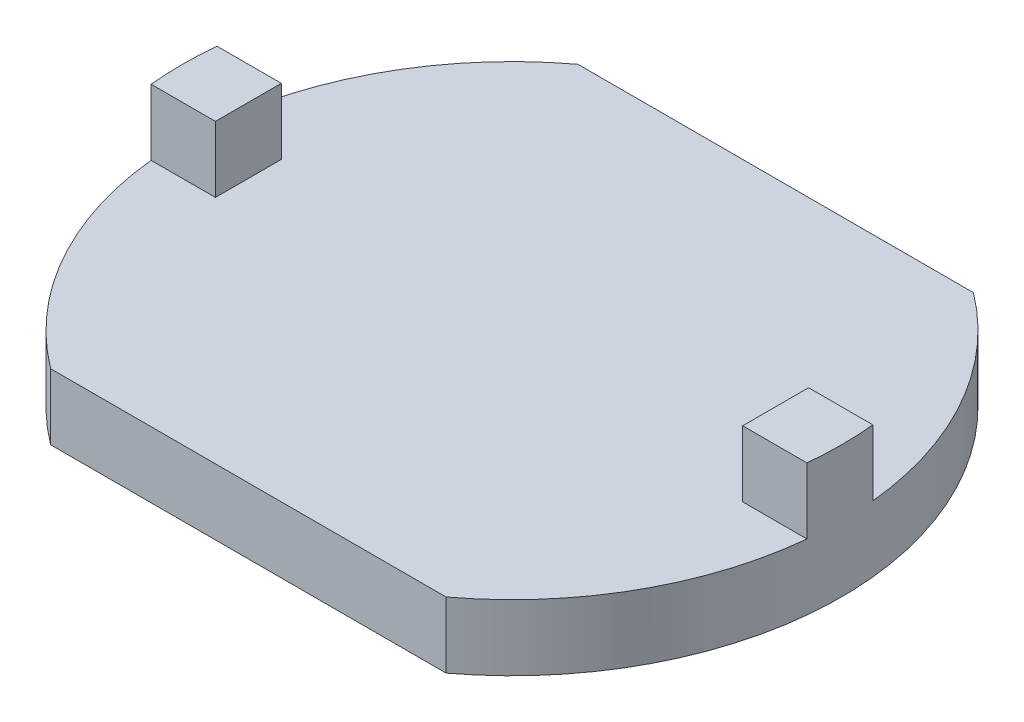
ISO-10303-21;
HEADER;
FILE_DESCRIPTION(('STEP AP214'),'2;1');
FILE_NAME('part.step','',(''),(''),'','','');
FILE_SCHEMA(('AUTOMOTIVE_DESIGN { 1 0 10303 214 1 1 1 1 }'));
ENDSEC;
DATA;
#1=APPLICATION_CONTEXT('core data for automotive mechanical design processes');
#2=APPLICATION_PROTOCOL_DEFINITION('international standard','automotive_design',2000,#1);
#3=PRODUCT_CONTEXT('',#1,'mechanical');
#4=PRODUCT('Part','Part','',(#3));
#5=PRODUCT_RELATED_PRODUCT_CATEGORY('part','',(#4));
#6=PRODUCT_DEFINITION_FORMATION('','',#4);
#7=PRODUCT_DEFINITION_CONTEXT('part definition',#1,'design');
#8=PRODUCT_DEFINITION('design','',#6,#7);
#9=PRODUCT_DEFINITION_SHAPE('','',#8);
#10=(LENGTH_UNIT() NAMED_UNIT(*) SI_UNIT(.MILLI.,.METRE.));
#11=(NAMED_UNIT(*) PLANE_ANGLE_UNIT() SI_UNIT($,.RADIAN.));
#12=(NAMED_UNIT(*) SI_UNIT($,.STERADIAN.) SOLID_ANGLE_UNIT());
#13=UNCERTAINTY_MEASURE_WITH_UNIT(LENGTH_MEASURE(1.E-05),#10,'distance_accuracy_value','');
#14=(GEOMETRIC_REPRESENTATION_CONTEXT(3) GLOBAL_UNCERTAINTY_ASSIGNED_CONTEXT((#13)) GLOBAL_UNIT_ASSIGNED_CONTEXT((#10,
#11,#12)) REPRESENTATION_CONTEXT('',''));
#15=CARTESIAN_POINT('',(0.,0.,0.));
#16=DIRECTION('',(0.,0.,1.));
#17=DIRECTION('',(1.,0.,0.));
#18=AXIS2_PLACEMENT_3D('',#15,#16,#17);
#19=CARTESIAN_POINT('',(0.,1.,0.));
#20=DIRECTION('',(0.,1.,0.));
#21=DIRECTION('',(0.,0.,1.));
#22=AXIS2_PLACEMENT_3D('',#19,#20,#21);
#23=PLANE('',#22);
#24=DIRECTION('',(-1.,0.,0.));
#25=VECTOR('',#24,1.);
#26=CARTESIAN_POINT('',(-4.,1.,0.5));
#27=LINE('',#26,#25);
#28=CARTESIAN_POINT('',(-4.,1.,0.5));
#29=VERTEX_POINT('',#28);
#30=CARTESIAN_POINT('',(-4.9749371855331,1.,0.499999999999996));
#31=VERTEX_POINT('',#30);
#32=EDGE_CURVE('E137',#29,#31,#27,.T.);
#33=ORIENTED_EDGE('',*,*,#32,.T.);
#34=CARTESIAN_POINT('',(0.,1.,0.));
#35=DIRECTION('',(0.,1.,0.));
#36=DIRECTION('',(0.,0.,1.));
#37=AXIS2_PLACEMENT_3D('',#34,#35,#36);
#38=CIRCLE('',#37,5.);
#39=CARTESIAN_POINT('',(-3.,1.,4.));
#40=VERTEX_POINT('',#39);
#41=EDGE_CURVE('E125',#31,#40,#38,.T.);
#42=ORIENTED_EDGE('',*,*,#41,.T.);
#43=DIRECTION('',(1.,0.,0.));
#44=VECTOR('',#43,1.);
#45=CARTESIAN_POINT('',(-3.,1.,4.));
#46=LINE('',#45,#44);
#47=CARTESIAN_POINT('',(3.,1.,4.));
#48=VERTEX_POINT('',#47);
#49=EDGE_CURVE('E134',#40,#48,#46,.T.);
#50=ORIENTED_EDGE('',*,*,#49,.T.);
#51=CARTESIAN_POINT('',(0.,1.,0.));
#52=DIRECTION('',(0.,1.,0.));
#53=DIRECTION('',(0.,0.,1.));
#54=AXIS2_PLACEMENT_3D('',#51,#52,#53);
#55=CIRCLE('',#54,5.);
#56=CARTESIAN_POINT('',(4.9749371855331,1.,0.5));
#57=VERTEX_POINT('',#56);
#58=EDGE_CURVE('E196',#48,#57,#55,.T.);
#59=ORIENTED_EDGE('',*,*,#58,.T.);
#60=DIRECTION('',(1.,0.,0.));
#61=VECTOR('',#60,1.);
#62=CARTESIAN_POINT('',(0.,1.,0.5));
#63=LINE('',#62,#61);
#64=CARTESIAN_POINT('',(4.,1.,0.5));
#65=VERTEX_POINT('',#64);
#66=EDGE_CURVE('E167',#65,#57,#63,.T.);
#67=ORIENTED_EDGE('',*,*,#66,.F.);
#68=DIRECTION('',(0.,0.,-1.));
#69=VECTOR('',#68,1.);
#70=CARTESIAN_POINT('',(4.,1.,0.));
#71=LINE('',#70,#69);
#72=CARTESIAN_POINT('',(4.,1.,-0.5));
#73=VERTEX_POINT('',#72);
#74=EDGE_CURVE('E177',#65,#73,#71,.T.);
#75=ORIENTED_EDGE('',*,*,#74,.T.);
#76=DIRECTION('',(1.,0.,0.));
#77=VECTOR('',#76,1.);
#78=CARTESIAN_POINT('',(0.,1.,-0.5));
#79=LINE('',#78,#77);
#80=CARTESIAN_POINT('',(4.9749371855331,1.,-0.5));
#81=VERTEX_POINT('',#80);
#82=EDGE_CURVE('E139',#73,#81,#79,.T.);
#83=ORIENTED_EDGE('',*,*,#82,.T.);
#84=CARTESIAN_POINT('',(3.,1.,-4.));
#85=VERTEX_POINT('',#84);
#86=EDGE_CURVE('E194',#81,#85,#55,.T.);
#87=ORIENTED_EDGE('',*,*,#86,.T.);
#88=DIRECTION('',(1.,0.,0.));
#89=VECTOR('',#88,1.);
#90=CARTESIAN_POINT('',(-3.,1.,-4.));
#91=LINE('',#90,#89);
#92=CARTESIAN_POINT('',(-3.,1.,-4.));
#93=VERTEX_POINT('',#92);
#94=EDGE_CURVE('E191',#93,#85,#91,.T.);
#95=ORIENTED_EDGE('',*,*,#94,.F.);
#96=CARTESIAN_POINT('',(-4.9749371855331,1.,-0.499999999999998));
#97=VERTEX_POINT('',#96);
#98=EDGE_CURVE('E133',#93,#97,#38,.T.);
#99=ORIENTED_EDGE('',*,*,#98,.T.);
#100=DIRECTION('',(-1.,0.,0.));
#101=VECTOR('',#100,1.);
#102=CARTESIAN_POINT('',(-4.,1.,-0.5));
#103=LINE('',#102,#101);
#104=CARTESIAN_POINT('',(-4.,1.,-0.5));
#105=VERTEX_POINT('',#104);
#106=EDGE_CURVE('E58',#105,#97,#103,.T.);
#107=ORIENTED_EDGE('',*,*,#106,.F.);
#108=DIRECTION('',(0.,0.,-1.));
#109=VECTOR('',#108,1.);
#110=CARTESIAN_POINT('',(-4.,1.,0.5));
#111=LINE('',#110,#109);
#112=EDGE_CURVE('E53',#29,#105,#111,.T.);
#113=ORIENTED_EDGE('',*,*,#112,.F.);
#114=EDGE_LOOP('',(#33,#42,#50,#59,#67,#75,#83,#87,#95,#99,#107,#113));
#115=FACE_BOUND('',#114,.T.);
#116=ADVANCED_FACE('F36',(#115),#23,.T.);
#117=CARTESIAN_POINT('',(-3.,1.,-4.));
#118=DIRECTION('',(0.,0.,-1.));
#119=DIRECTION('',(-1.,0.,0.));
#120=AXIS2_PLACEMENT_3D('',#117,#118,#119);
#121=PLANE('',#120);
#122=DIRECTION('',(1.,0.,0.));
#123=VECTOR('',#122,1.);
#124=CARTESIAN_POINT('',(-3.,0.,-4.));
#125=LINE('',#124,#123);
#126=CARTESIAN_POINT('',(-3.,0.,-4.));
#127=VERTEX_POINT('',#126);
#128=CARTESIAN_POINT('',(3.,0.,-4.));
#129=VERTEX_POINT('',#128);
#130=EDGE_CURVE('E190',#127,#129,#125,.T.);
#131=ORIENTED_EDGE('',*,*,#130,.F.);
#132=DIRECTION('',(0.,-1.,0.));
#133=VECTOR('',#132,1.);
#134=CARTESIAN_POINT('',(-3.,1.,-4.));
#135=LINE('',#134,#133);
#136=EDGE_CURVE('E11',#93,#127,#135,.T.);
#137=ORIENTED_EDGE('',*,*,#136,.F.);
#138=ORIENTED_EDGE('',*,*,#94,.T.);
#139=DIRECTION('',(0.,-1.,0.));
#140=VECTOR('',#139,1.);
#141=CARTESIAN_POINT('',(3.,1.,-4.));
#142=LINE('',#141,#140);
#143=EDGE_CURVE('E40',#85,#129,#142,.T.);
#144=ORIENTED_EDGE('',*,*,#143,.T.);
#145=EDGE_LOOP('',(#131,#137,#138,#144));
#146=FACE_BOUND('',#145,.T.);
#147=ADVANCED_FACE('F38',(#146),#121,.T.);
#148=CARTESIAN_POINT('',(0.,1.,0.));
#149=DIRECTION('',(0.,-1.,0.));
#150=DIRECTION('',(0.,0.,-1.));
#151=AXIS2_PLACEMENT_3D('',#148,#149,#150);
#152=CYLINDRICAL_SURFACE('',#151,5.);
#153=CARTESIAN_POINT('',(0.,0.,0.));
#154=DIRECTION('',(0.,1.,0.));
#155=DIRECTION('',(0.,0.,1.));
#156=AXIS2_PLACEMENT_3D('',#153,#154,#155);
#157=CIRCLE('',#156,5.);
#158=CARTESIAN_POINT('',(-3.,0.,4.));
#159=VERTEX_POINT('',#158);
#160=EDGE_CURVE('E195',#127,#159,#157,.T.);
#161=ORIENTED_EDGE('',*,*,#160,.T.);
#162=DIRECTION('',(0.,-1.,0.));
#163=VECTOR('',#162,1.);
#164=CARTESIAN_POINT('',(-3.,1.,4.));
#165=LINE('',#164,#163);
#166=EDGE_CURVE('E45',#40,#159,#165,.T.);
#167=ORIENTED_EDGE('',*,*,#166,.F.);
#168=ORIENTED_EDGE('',*,*,#41,.F.);
#169=DIRECTION('',(0.,-1.,0.));
#170=VECTOR('',#169,1.);
#171=CARTESIAN_POINT('',(-4.9749371855331,2.,0.499999999999996));
#172=LINE('',#171,#170);
#173=CARTESIAN_POINT('',(-4.9749371855331,2.,0.499999999999996));
#174=VERTEX_POINT('',#173);
#175=EDGE_CURVE('E129',#174,#31,#172,.T.);
#176=ORIENTED_EDGE('',*,*,#175,.F.);
#177=CARTESIAN_POINT('',(6.86083134748827E-13,2.,0.));
#178=DIRECTION('',(0.,1.,0.));
#179=DIRECTION('',(0.,0.,1.));
#180=AXIS2_PLACEMENT_3D('',#177,#178,#179);
#181=CIRCLE('',#180,5.00000000000068);
#182=CARTESIAN_POINT('',(-4.9749371855331,2.,-0.499999999999998));
#183=VERTEX_POINT('',#182);
#184=EDGE_CURVE('E160',#183,#174,#181,.T.);
#185=ORIENTED_EDGE('',*,*,#184,.F.);
#186=DIRECTION('',(0.,-1.,0.));
#187=VECTOR('',#186,1.);
#188=CARTESIAN_POINT('',(-4.9749371855331,2.,-0.499999999999998));
#189=LINE('',#188,#187);
#190=EDGE_CURVE('E145',#183,#97,#189,.T.);
#191=ORIENTED_EDGE('',*,*,#190,.T.);
#192=ORIENTED_EDGE('',*,*,#98,.F.);
#193=ORIENTED_EDGE('',*,*,#136,.T.);
#194=EDGE_LOOP('',(#161,#167,#168,#176,#185,#191,#192,#193));
#195=FACE_BOUND('',#194,.T.);
#196=ADVANCED_FACE('F126',(#195),#152,.T.);
#197=CARTESIAN_POINT('',(-3.,1.,4.));
#198=DIRECTION('',(0.,0.,-1.));
#199=DIRECTION('',(-1.,0.,0.));
#200=AXIS2_PLACEMENT_3D('',#197,#198,#199);
#201=PLANE('',#200);
#202=DIRECTION('',(1.,0.,0.));
#203=VECTOR('',#202,1.);
#204=CARTESIAN_POINT('',(-3.,0.,4.));
#205=LINE('',#204,#203);
#206=CARTESIAN_POINT('',(3.,0.,4.));
#207=VERTEX_POINT('',#206);
#208=EDGE_CURVE('E205',#159,#207,#205,.T.);
#209=ORIENTED_EDGE('',*,*,#208,.T.);
#210=DIRECTION('',(0.,-1.,0.));
#211=VECTOR('',#210,1.);
#212=CARTESIAN_POINT('',(3.,1.,4.));
#213=LINE('',#212,#211);
#214=EDGE_CURVE('E208',#48,#207,#213,.T.);
#215=ORIENTED_EDGE('',*,*,#214,.F.);
#216=ORIENTED_EDGE('',*,*,#49,.F.);
#217=ORIENTED_EDGE('',*,*,#166,.T.);
#218=EDGE_LOOP('',(#209,#215,#216,#217));
#219=FACE_BOUND('',#218,.T.);
#220=ADVANCED_FACE('F226',(#219),#201,.F.);
#221=CARTESIAN_POINT('',(0.,1.,0.));
#222=DIRECTION('',(0.,-1.,0.));
#223=DIRECTION('',(0.,0.,-1.));
#224=AXIS2_PLACEMENT_3D('',#221,#222,#223);
#225=CYLINDRICAL_SURFACE('',#224,5.);
#226=CARTESIAN_POINT('',(0.,0.,0.));
#227=DIRECTION('',(0.,1.,0.));
#228=DIRECTION('',(0.,0.,1.));
#229=AXIS2_PLACEMENT_3D('',#226,#227,#228);
#230=CIRCLE('',#229,5.);
#231=EDGE_CURVE('E202',#207,#129,#230,.T.);
#232=ORIENTED_EDGE('',*,*,#231,.T.);
#233=ORIENTED_EDGE('',*,*,#143,.F.);
#234=ORIENTED_EDGE('',*,*,#86,.F.);
#235=DIRECTION('',(0.,-1.,0.));
#236=VECTOR('',#235,1.);
#237=CARTESIAN_POINT('',(4.9749371855331,2.,-0.5));
#238=LINE('',#237,#236);
#239=CARTESIAN_POINT('',(4.9749371855331,2.,-0.5));
#240=VERTEX_POINT('',#239);
#241=EDGE_CURVE('E174',#240,#81,#238,.T.);
#242=ORIENTED_EDGE('',*,*,#241,.F.);
#243=CARTESIAN_POINT('',(0.,2.,0.));
#244=DIRECTION('',(0.,1.,0.));
#245=DIRECTION('',(0.,0.,1.));
#246=AXIS2_PLACEMENT_3D('',#243,#244,#245);
#247=CIRCLE('',#246,5.);
#248=CARTESIAN_POINT('',(4.9749371855331,2.,0.5));
#249=VERTEX_POINT('',#248);
#250=EDGE_CURVE('E172',#249,#240,#247,.T.);
#251=ORIENTED_EDGE('',*,*,#250,.F.);
#252=DIRECTION('',(0.,-1.,0.));
#253=VECTOR('',#252,1.);
#254=CARTESIAN_POINT('',(4.9749371855331,2.,0.5));
#255=LINE('',#254,#253);
#256=EDGE_CURVE('E182',#249,#57,#255,.T.);
#257=ORIENTED_EDGE('',*,*,#256,.T.);
#258=ORIENTED_EDGE('',*,*,#58,.F.);
#259=ORIENTED_EDGE('',*,*,#214,.T.);
#260=EDGE_LOOP('',(#232,#233,#234,#242,#251,#257,#258,#259));
#261=FACE_BOUND('',#260,.T.);
#262=ADVANCED_FACE('F219',(#261),#225,.T.);
#263=CARTESIAN_POINT('',(0.,0.,0.));
#264=DIRECTION('',(0.,1.,0.));
#265=DIRECTION('',(0.,0.,1.));
#266=AXIS2_PLACEMENT_3D('',#263,#264,#265);
#267=PLANE('',#266);
#268=ORIENTED_EDGE('',*,*,#130,.T.);
#269=ORIENTED_EDGE('',*,*,#231,.F.);
#270=ORIENTED_EDGE('',*,*,#208,.F.);
#271=ORIENTED_EDGE('',*,*,#160,.F.);
#272=EDGE_LOOP('',(#268,#269,#270,#271));
#273=FACE_BOUND('',#272,.T.);
#274=ADVANCED_FACE('F223',(#273),#267,.F.);
#275=CARTESIAN_POINT('',(0.,2.,-0.5));
#276=DIRECTION('',(0.,0.,-1.));
#277=DIRECTION('',(-1.,0.,0.));
#278=AXIS2_PLACEMENT_3D('',#275,#276,#277);
#279=PLANE('',#278);
#280=ORIENTED_EDGE('',*,*,#82,.F.);
#281=DIRECTION('',(0.,-1.,0.));
#282=VECTOR('',#281,1.);
#283=CARTESIAN_POINT('',(4.,2.,-0.5));
#284=LINE('',#283,#282);
#285=CARTESIAN_POINT('',(4.,2.,-0.5));
#286=VERTEX_POINT('',#285);
#287=EDGE_CURVE('E187',#286,#73,#284,.T.);
#288=ORIENTED_EDGE('',*,*,#287,.F.);
#289=DIRECTION('',(1.,0.,0.));
#290=VECTOR('',#289,1.);
#291=CARTESIAN_POINT('',(0.,2.,-0.5));
#292=LINE('',#291,#290);
#293=EDGE_CURVE('E163',#286,#240,#292,.T.);
#294=ORIENTED_EDGE('',*,*,#293,.T.);
#295=ORIENTED_EDGE('',*,*,#241,.T.);
#296=EDGE_LOOP('',(#280,#288,#294,#295));
#297=FACE_BOUND('',#296,.T.);
#298=ADVANCED_FACE('F240',(#297),#279,.T.);
#299=CARTESIAN_POINT('',(4.,2.,0.));
#300=DIRECTION('',(-1.,0.,0.));
#301=DIRECTION('',(0.,0.,1.));
#302=AXIS2_PLACEMENT_3D('',#299,#300,#301);
#303=PLANE('',#302);
#304=ORIENTED_EDGE('',*,*,#74,.F.);
#305=DIRECTION('',(0.,-1.,0.));
#306=VECTOR('',#305,1.);
#307=CARTESIAN_POINT('',(4.,2.,0.5));
#308=LINE('',#307,#306);
#309=CARTESIAN_POINT('',(4.,2.,0.5));
#310=VERTEX_POINT('',#309);
#311=EDGE_CURVE('E185',#310,#65,#308,.T.);
#312=ORIENTED_EDGE('',*,*,#311,.F.);
#313=DIRECTION('',(0.,0.,-1.));
#314=VECTOR('',#313,1.);
#315=CARTESIAN_POINT('',(4.,2.,0.));
#316=LINE('',#315,#314);
#317=EDGE_CURVE('E166',#310,#286,#316,.T.);
#318=ORIENTED_EDGE('',*,*,#317,.T.);
#319=ORIENTED_EDGE('',*,*,#287,.T.);
#320=EDGE_LOOP('',(#304,#312,#318,#319));
#321=FACE_BOUND('',#320,.T.);
#322=ADVANCED_FACE('F237',(#321),#303,.T.);
#323=CARTESIAN_POINT('',(0.,2.,0.5));
#324=DIRECTION('',(0.,0.,-1.));
#325=DIRECTION('',(-1.,0.,0.));
#326=AXIS2_PLACEMENT_3D('',#323,#324,#325);
#327=PLANE('',#326);
#328=ORIENTED_EDGE('',*,*,#66,.T.);
#329=ORIENTED_EDGE('',*,*,#256,.F.);
#330=DIRECTION('',(1.,0.,0.));
#331=VECTOR('',#330,1.);
#332=CARTESIAN_POINT('',(0.,2.,0.5));
#333=LINE('',#332,#331);
#334=EDGE_CURVE('E170',#310,#249,#333,.T.);
#335=ORIENTED_EDGE('',*,*,#334,.F.);
#336=ORIENTED_EDGE('',*,*,#311,.T.);
#337=EDGE_LOOP('',(#328,#329,#335,#336));
#338=FACE_BOUND('',#337,.T.);
#339=ADVANCED_FACE('F233',(#338),#327,.F.);
#340=CARTESIAN_POINT('',(0.,2.,0.));
#341=DIRECTION('',(0.,1.,0.));
#342=DIRECTION('',(0.,0.,1.));
#343=AXIS2_PLACEMENT_3D('',#340,#341,#342);
#344=PLANE('',#343);
#345=ORIENTED_EDGE('',*,*,#293,.F.);
#346=ORIENTED_EDGE('',*,*,#317,.F.);
#347=ORIENTED_EDGE('',*,*,#334,.T.);
#348=ORIENTED_EDGE('',*,*,#250,.T.);
#349=EDGE_LOOP('',(#345,#346,#347,#348));
#350=FACE_BOUND('',#349,.T.);
#351=ADVANCED_FACE('F242',(#350),#344,.T.);
#352=CARTESIAN_POINT('',(-4.,2.,0.5));
#353=DIRECTION('',(0.,0.,1.));
#354=DIRECTION('',(1.,0.,0.));
#355=AXIS2_PLACEMENT_3D('',#352,#353,#354);
#356=PLANE('',#355);
#357=ORIENTED_EDGE('',*,*,#32,.F.);
#358=DIRECTION('',(0.,-1.,0.));
#359=VECTOR('',#358,1.);
#360=CARTESIAN_POINT('',(-4.,2.,0.5));
#361=LINE('',#360,#359);
#362=CARTESIAN_POINT('',(-4.,2.,0.5));
#363=VERTEX_POINT('',#362);
#364=EDGE_CURVE('E155',#363,#29,#361,.T.);
#365=ORIENTED_EDGE('',*,*,#364,.F.);
#366=DIRECTION('',(-1.,0.,0.));
#367=VECTOR('',#366,1.);
#368=CARTESIAN_POINT('',(-4.,2.,0.5));
#369=LINE('',#368,#367);
#370=EDGE_CURVE('E143',#363,#174,#369,.T.);
#371=ORIENTED_EDGE('',*,*,#370,.T.);
#372=ORIENTED_EDGE('',*,*,#175,.T.);
#373=EDGE_LOOP('',(#357,#365,#371,#372));
#374=FACE_BOUND('',#373,.T.);
#375=ADVANCED_FACE('F141',(#374),#356,.T.);
#376=CARTESIAN_POINT('',(-4.,2.,0.5));
#377=DIRECTION('',(-1.,0.,0.));
#378=DIRECTION('',(0.,0.,1.));
#379=AXIS2_PLACEMENT_3D('',#376,#377,#378);
#380=PLANE('',#379);
#381=ORIENTED_EDGE('',*,*,#112,.T.);
#382=DIRECTION('',(0.,-1.,0.));
#383=VECTOR('',#382,1.);
#384=CARTESIAN_POINT('',(-4.,2.,-0.5));
#385=LINE('',#384,#383);
#386=CARTESIAN_POINT('',(-4.,2.,-0.5));
#387=VERTEX_POINT('',#386);
#388=EDGE_CURVE('E150',#387,#105,#385,.T.);
#389=ORIENTED_EDGE('',*,*,#388,.F.);
#390=DIRECTION('',(0.,0.,-1.));
#391=VECTOR('',#390,1.);
#392=CARTESIAN_POINT('',(-4.,2.,0.5));
#393=LINE('',#392,#391);
#394=EDGE_CURVE('E144',#363,#387,#393,.T.);
#395=ORIENTED_EDGE('',*,*,#394,.F.);
#396=ORIENTED_EDGE('',*,*,#364,.T.);
#397=EDGE_LOOP('',(#381,#389,#395,#396));
#398=FACE_BOUND('',#397,.T.);
#399=ADVANCED_FACE('F249',(#398),#380,.F.);
#400=CARTESIAN_POINT('',(-4.,2.,-0.5));
#401=DIRECTION('',(0.,0.,1.));
#402=DIRECTION('',(1.,0.,0.));
#403=AXIS2_PLACEMENT_3D('',#400,#401,#402);
#404=PLANE('',#403);
#405=ORIENTED_EDGE('',*,*,#106,.T.);
#406=ORIENTED_EDGE('',*,*,#190,.F.);
#407=DIRECTION('',(-1.,0.,0.));
#408=VECTOR('',#407,1.);
#409=CARTESIAN_POINT('',(-4.,2.,-0.5));
#410=LINE('',#409,#408);
#411=EDGE_CURVE('E147',#387,#183,#410,.T.);
#412=ORIENTED_EDGE('',*,*,#411,.F.);
#413=ORIENTED_EDGE('',*,*,#388,.T.);
#414=EDGE_LOOP('',(#405,#406,#412,#413));
#415=FACE_BOUND('',#414,.T.);
#416=ADVANCED_FACE('F309',(#415),#404,.F.);
#417=CARTESIAN_POINT('',(6.86083134748827E-13,2.,0.));
#418=DIRECTION('',(0.,1.,0.));
#419=DIRECTION('',(0.,0.,1.));
#420=AXIS2_PLACEMENT_3D('',#417,#418,#419);
#421=PLANE('',#420);
#422=ORIENTED_EDGE('',*,*,#370,.F.);
#423=ORIENTED_EDGE('',*,*,#394,.T.);
#424=ORIENTED_EDGE('',*,*,#411,.T.);
#425=ORIENTED_EDGE('',*,*,#184,.T.);
#426=EDGE_LOOP('',(#422,#423,#424,#425));
#427=FACE_BOUND('',#426,.T.);
#428=ADVANCED_FACE('F319',(#427),#421,.T.);
#429=CLOSED_SHELL('',(#116,#147,#196,#220,#262,#274,#298,#322,#339,#351,#375,#399,#416,#428));
#430=MANIFOLD_SOLID_BREP('B2',#429);
#431=ADVANCED_BREP_SHAPE_REPRESENTATION('',(#18,#430),#14);
#432=SHAPE_DEFINITION_REPRESENTATION(#9,#431);
ENDSEC;
END-ISO-10303-21;
